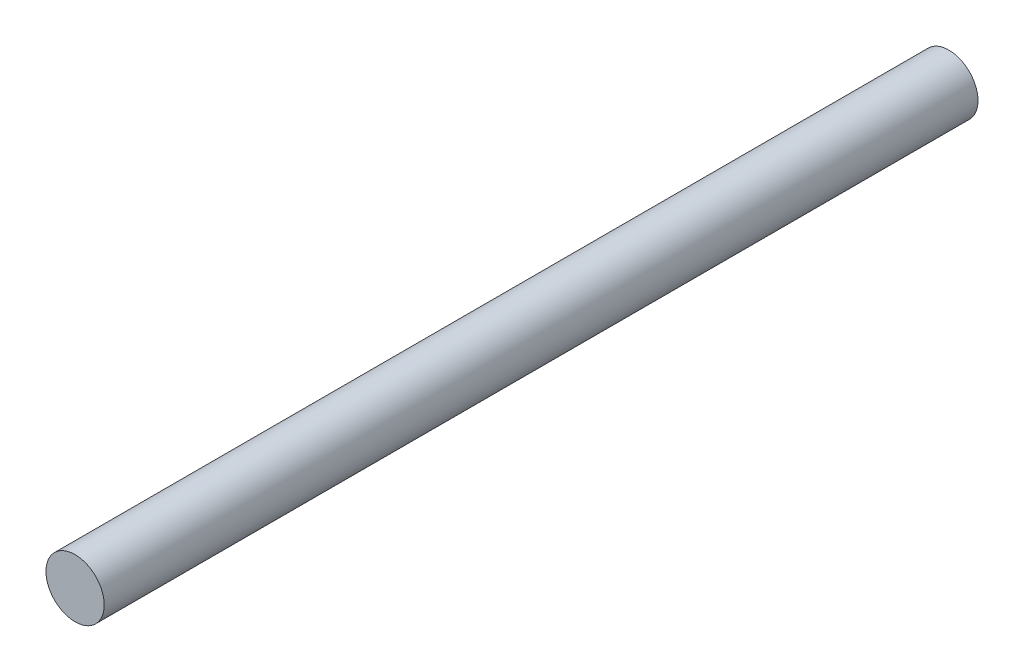
ISO-10303-21;
HEADER;
FILE_DESCRIPTION(('STEP AP214'),'2;1');
FILE_NAME('part.step','',(''),(''),'','','');
FILE_SCHEMA(('AUTOMOTIVE_DESIGN { 1 0 10303 214 1 1 1 1 }'));
ENDSEC;
DATA;
#1=APPLICATION_CONTEXT('core data for automotive mechanical design processes');
#2=APPLICATION_PROTOCOL_DEFINITION('international standard','automotive_design',2000,#1);
#3=PRODUCT_CONTEXT('',#1,'mechanical');
#4=PRODUCT('Part','Part','',(#3));
#5=PRODUCT_RELATED_PRODUCT_CATEGORY('part','',(#4));
#6=PRODUCT_DEFINITION_FORMATION('','',#4);
#7=PRODUCT_DEFINITION_CONTEXT('part definition',#1,'design');
#8=PRODUCT_DEFINITION('design','',#6,#7);
#9=PRODUCT_DEFINITION_SHAPE('','',#8);
#10=(LENGTH_UNIT() NAMED_UNIT(*) SI_UNIT(.MILLI.,.METRE.));
#11=(NAMED_UNIT(*) PLANE_ANGLE_UNIT() SI_UNIT($,.RADIAN.));
#12=(NAMED_UNIT(*) SI_UNIT($,.STERADIAN.) SOLID_ANGLE_UNIT());
#13=UNCERTAINTY_MEASURE_WITH_UNIT(LENGTH_MEASURE(1.E-05),#10,'distance_accuracy_value','');
#14=(GEOMETRIC_REPRESENTATION_CONTEXT(3) GLOBAL_UNCERTAINTY_ASSIGNED_CONTEXT((#13)) GLOBAL_UNIT_ASSIGNED_CONTEXT((#10,
#11,#12)) REPRESENTATION_CONTEXT('',''));
#15=CARTESIAN_POINT('',(0.,0.,0.));
#16=DIRECTION('',(0.,0.,1.));
#17=DIRECTION('',(1.,0.,0.));
#18=AXIS2_PLACEMENT_3D('',#15,#16,#17);
#19=CARTESIAN_POINT('',(0.,0.,90.));
#20=DIRECTION('',(0.,0.,-1.));
#21=DIRECTION('',(-1.,0.,0.));
#22=AXIS2_PLACEMENT_3D('',#19,#20,#21);
#23=CYLINDRICAL_SURFACE('',#22,6.);
#24=CARTESIAN_POINT('',(0.,0.,90.));
#25=DIRECTION('',(0.,0.,1.));
#26=DIRECTION('',(1.,0.,0.));
#27=AXIS2_PLACEMENT_3D('',#24,#25,#26);
#28=CIRCLE('',#27,6.);
#29=CARTESIAN_POINT('',(6.,0.,90.));
#30=VERTEX_POINT('',#29);
#31=EDGE_CURVE('E10',#30,#30,#28,.T.);
#32=ORIENTED_EDGE('',*,*,#31,.F.);
#33=EDGE_LOOP('',(#32));
#34=FACE_BOUND('',#33,.T.);
#35=CARTESIAN_POINT('',(0.,0.,-90.));
#36=DIRECTION('',(0.,0.,1.));
#37=DIRECTION('',(1.,0.,0.));
#38=AXIS2_PLACEMENT_3D('',#35,#36,#37);
#39=CIRCLE('',#38,6.);
#40=CARTESIAN_POINT('',(6.,0.,-90.));
#41=VERTEX_POINT('',#40);
#42=EDGE_CURVE('E38',#41,#41,#39,.T.);
#43=ORIENTED_EDGE('',*,*,#42,.T.);
#44=EDGE_LOOP('',(#43));
#45=FACE_BOUND('',#44,.T.);
#46=ADVANCED_FACE('F35',(#34,#45),#23,.T.);
#47=CARTESIAN_POINT('',(0.,0.,90.));
#48=DIRECTION('',(0.,0.,1.));
#49=DIRECTION('',(1.,0.,0.));
#50=AXIS2_PLACEMENT_3D('',#47,#48,#49);
#51=PLANE('',#50);
#52=ORIENTED_EDGE('',*,*,#31,.T.);
#53=EDGE_LOOP('',(#52));
#54=FACE_BOUND('',#53,.T.);
#55=ADVANCED_FACE('F50',(#54),#51,.T.);
#56=CARTESIAN_POINT('',(0.,0.,-90.));
#57=DIRECTION('',(0.,0.,1.));
#58=DIRECTION('',(1.,0.,0.));
#59=AXIS2_PLACEMENT_3D('',#56,#57,#58);
#60=PLANE('',#59);
#61=ORIENTED_EDGE('',*,*,#42,.F.);
#62=EDGE_LOOP('',(#61));
#63=FACE_BOUND('',#62,.T.);
#64=ADVANCED_FACE('F48',(#63),#60,.F.);
#65=CLOSED_SHELL('',(#46,#55,#64));
#66=MANIFOLD_SOLID_BREP('B2',#65);
#67=ADVANCED_BREP_SHAPE_REPRESENTATION('',(#18,#66),#14);
#68=SHAPE_DEFINITION_REPRESENTATION(#9,#67);
ENDSEC;
END-ISO-10303-21;
